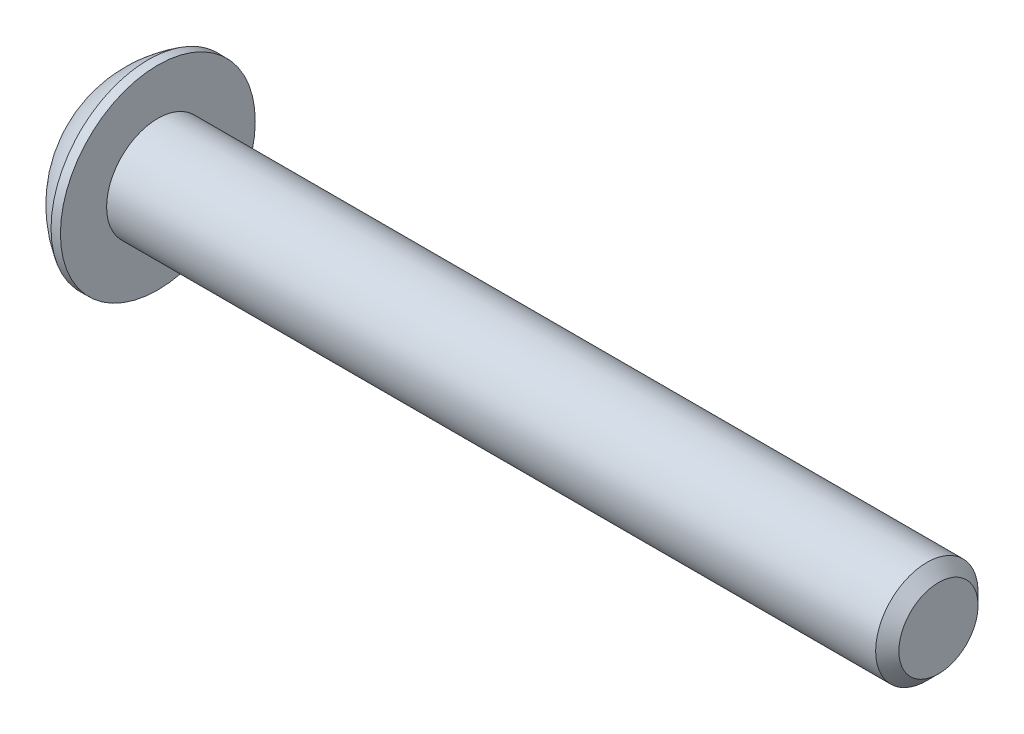
ISO-10303-21;
HEADER;
FILE_DESCRIPTION(('STEP AP214'),'2;1');
FILE_NAME('part.step','',(''),(''),'','','');
FILE_SCHEMA(('AUTOMOTIVE_DESIGN { 1 0 10303 214 1 1 1 1 }'));
ENDSEC;
DATA;
#1=APPLICATION_CONTEXT('core data for automotive mechanical design processes');
#2=APPLICATION_PROTOCOL_DEFINITION('international standard','automotive_design',2000,#1);
#3=PRODUCT_CONTEXT('',#1,'mechanical');
#4=PRODUCT('Part','Part','',(#3));
#5=PRODUCT_RELATED_PRODUCT_CATEGORY('part','',(#4));
#6=PRODUCT_DEFINITION_FORMATION('','',#4);
#7=PRODUCT_DEFINITION_CONTEXT('part definition',#1,'design');
#8=PRODUCT_DEFINITION('design','',#6,#7);
#9=PRODUCT_DEFINITION_SHAPE('','',#8);
#10=(LENGTH_UNIT() NAMED_UNIT(*) SI_UNIT(.MILLI.,.METRE.));
#11=(NAMED_UNIT(*) PLANE_ANGLE_UNIT() SI_UNIT($,.RADIAN.));
#12=(NAMED_UNIT(*) SI_UNIT($,.STERADIAN.) SOLID_ANGLE_UNIT());
#13=UNCERTAINTY_MEASURE_WITH_UNIT(LENGTH_MEASURE(1.E-05),#10,'distance_accuracy_value','');
#14=(GEOMETRIC_REPRESENTATION_CONTEXT(3) GLOBAL_UNCERTAINTY_ASSIGNED_CONTEXT((#13)) GLOBAL_UNIT_ASSIGNED_CONTEXT((#10,
#11,#12)) REPRESENTATION_CONTEXT('',''));
#15=CARTESIAN_POINT('',(0.,0.,0.));
#16=DIRECTION('',(0.,0.,1.));
#17=DIRECTION('',(1.,0.,0.));
#18=AXIS2_PLACEMENT_3D('',#15,#16,#17);
#19=CARTESIAN_POINT('',(1.32080000000034,0.,0.));
#20=DIRECTION('',(-1.,0.,0.));
#21=DIRECTION('',(0.,0.,1.));
#22=AXIS2_PLACEMENT_3D('',#19,#20,#21);
#23=CONICAL_SURFACE('',#22,1.1937999999998,1.04719755119608);
#24=CARTESIAN_POINT('',(2.01004075135902,0.,4.44089209850063E-13));
#25=VERTEX_POINT('',#24);
#26=VERTEX_LOOP('',#25);
#27=FACE_BOUND('',#26,.T.);
#28=CARTESIAN_POINT('',(1.32080000000009,0.,0.));
#29=DIRECTION('',(-1.,0.,0.));
#30=DIRECTION('',(0.,0.,1.));
#31=AXIS2_PLACEMENT_3D('',#28,#29,#30);
#32=CIRCLE('',#31,1.19380000000024);
#33=CARTESIAN_POINT('',(1.32080000000004,-1.03386112703797,0.59690000000006));
#34=VERTEX_POINT('',#33);
#35=CARTESIAN_POINT('',(1.32080000000004,0.,1.19380000000012));
#36=VERTEX_POINT('',#35);
#37=EDGE_CURVE('E19',#34,#36,#32,.T.);
#38=ORIENTED_EDGE('',*,*,#37,.T.);
#39=CARTESIAN_POINT('',(1.32080000000009,0.,0.));
#40=DIRECTION('',(-1.,0.,0.));
#41=DIRECTION('',(0.,0.,1.));
#42=AXIS2_PLACEMENT_3D('',#39,#40,#41);
#43=CIRCLE('',#42,1.19380000000024);
#44=CARTESIAN_POINT('',(1.32080000000004,1.03386112703797,0.596900000000061));
#45=VERTEX_POINT('',#44);
#46=EDGE_CURVE('E148',#36,#45,#43,.T.);
#47=ORIENTED_EDGE('',*,*,#46,.T.);
#48=CARTESIAN_POINT('',(1.32080000000009,0.,0.));
#49=DIRECTION('',(-1.,0.,0.));
#50=DIRECTION('',(0.,0.,1.));
#51=AXIS2_PLACEMENT_3D('',#48,#49,#50);
#52=CIRCLE('',#51,1.19380000000024);
#53=CARTESIAN_POINT('',(1.32080000000004,1.03386112703797,-0.596900000000061));
#54=VERTEX_POINT('',#53);
#55=EDGE_CURVE('E318',#45,#54,#52,.T.);
#56=ORIENTED_EDGE('',*,*,#55,.T.);
#57=CARTESIAN_POINT('',(1.32080000000009,0.,0.));
#58=DIRECTION('',(-1.,0.,0.));
#59=DIRECTION('',(0.,0.,1.));
#60=AXIS2_PLACEMENT_3D('',#57,#58,#59);
#61=CIRCLE('',#60,1.19380000000024);
#62=CARTESIAN_POINT('',(1.32080000000004,1.49457637585666E-12,-1.19380000000012));
#63=VERTEX_POINT('',#62);
#64=EDGE_CURVE('E319',#54,#63,#61,.T.);
#65=ORIENTED_EDGE('',*,*,#64,.T.);
#66=CARTESIAN_POINT('',(1.32080000000009,0.,0.));
#67=DIRECTION('',(-1.,0.,0.));
#68=DIRECTION('',(0.,0.,1.));
#69=AXIS2_PLACEMENT_3D('',#66,#67,#68);
#70=CIRCLE('',#69,1.19380000000024);
#71=CARTESIAN_POINT('',(1.32080000000004,-1.03386112703797,-0.59690000000006));
#72=VERTEX_POINT('',#71);
#73=EDGE_CURVE('E92',#63,#72,#70,.T.);
#74=ORIENTED_EDGE('',*,*,#73,.T.);
#75=CARTESIAN_POINT('',(1.32080000000009,0.,0.));
#76=DIRECTION('',(-1.,0.,0.));
#77=DIRECTION('',(0.,0.,1.));
#78=AXIS2_PLACEMENT_3D('',#75,#76,#77);
#79=CIRCLE('',#78,1.19380000000024);
#80=EDGE_CURVE('E88',#72,#34,#79,.T.);
#81=ORIENTED_EDGE('',*,*,#80,.T.);
#82=EDGE_LOOP('',(#38,#47,#56,#65,#74,#81));
#83=FACE_BOUND('',#82,.T.);
#84=ADVANCED_FACE('F16',(#27,#83),#23,.F.);
#85=CARTESIAN_POINT('',(1.3208,-2.06772225407572,-1.1938));
#86=DIRECTION('',(1.,0.,0.));
#87=DIRECTION('',(0.,0.,-1.));
#88=AXIS2_PLACEMENT_3D('',#85,#86,#87);
#89=PLANE('',#88);
#90=DIRECTION('',(0.,0.5,0.866025403784439));
#91=VECTOR('',#90,1.);
#92=CARTESIAN_POINT('',(1.3208,-1.37848150271715,0.));
#93=LINE('',#92,#91);
#94=CARTESIAN_POINT('',(1.3208,-0.689240751358574,1.1938));
#95=VERTEX_POINT('',#94);
#96=EDGE_CURVE('E100',#95,#34,#93,.F.);
#97=ORIENTED_EDGE('',*,*,#96,.F.);
#98=DIRECTION('',(0.,1.,0.));
#99=VECTOR('',#98,1.);
#100=CARTESIAN_POINT('',(1.3208,-0.689240751358574,1.1938));
#101=LINE('',#100,#99);
#102=EDGE_CURVE('E102',#36,#95,#101,.F.);
#103=ORIENTED_EDGE('',*,*,#102,.F.);
#104=ORIENTED_EDGE('',*,*,#37,.F.);
#105=EDGE_LOOP('',(#97,#103,#104));
#106=FACE_BOUND('',#105,.T.);
#107=ADVANCED_FACE('F98',(#106),#89,.F.);
#108=CARTESIAN_POINT('',(1.3208,-2.06772225407572,-1.1938));
#109=DIRECTION('',(1.,0.,0.));
#110=DIRECTION('',(0.,0.,-1.));
#111=AXIS2_PLACEMENT_3D('',#108,#109,#110);
#112=PLANE('',#111);
#113=DIRECTION('',(0.,-0.5,0.866025403784439));
#114=VECTOR('',#113,1.);
#115=CARTESIAN_POINT('',(1.3208,-0.689240751358574,-1.1938));
#116=LINE('',#115,#114);
#117=CARTESIAN_POINT('',(1.3208,-1.37848150271715,0.));
#118=VERTEX_POINT('',#117);
#119=EDGE_CURVE('E108',#118,#72,#116,.F.);
#120=ORIENTED_EDGE('',*,*,#119,.F.);
#121=DIRECTION('',(0.,0.5,0.866025403784439));
#122=VECTOR('',#121,1.);
#123=CARTESIAN_POINT('',(1.3208,-1.37848150271715,0.));
#124=LINE('',#123,#122);
#125=EDGE_CURVE('E105',#34,#118,#124,.F.);
#126=ORIENTED_EDGE('',*,*,#125,.F.);
#127=ORIENTED_EDGE('',*,*,#80,.F.);
#128=EDGE_LOOP('',(#120,#126,#127));
#129=FACE_BOUND('',#128,.T.);
#130=ADVANCED_FACE('F106',(#129),#112,.F.);
#131=CARTESIAN_POINT('',(1.3208,-2.06772225407572,-1.1938));
#132=DIRECTION('',(1.,0.,0.));
#133=DIRECTION('',(0.,0.,-1.));
#134=AXIS2_PLACEMENT_3D('',#131,#132,#133);
#135=PLANE('',#134);
#136=DIRECTION('',(0.,1.,0.));
#137=VECTOR('',#136,1.);
#138=CARTESIAN_POINT('',(1.3208,0.689240751358577,-1.1938));
#139=LINE('',#138,#137);
#140=CARTESIAN_POINT('',(1.3208,-0.689240751358574,-1.1938));
#141=VERTEX_POINT('',#140);
#142=EDGE_CURVE('E288',#141,#63,#139,.T.);
#143=ORIENTED_EDGE('',*,*,#142,.F.);
#144=DIRECTION('',(0.,-0.5,0.866025403784439));
#145=VECTOR('',#144,1.);
#146=CARTESIAN_POINT('',(1.3208,-0.689240751358574,-1.1938));
#147=LINE('',#146,#145);
#148=EDGE_CURVE('E300',#72,#141,#147,.F.);
#149=ORIENTED_EDGE('',*,*,#148,.F.);
#150=ORIENTED_EDGE('',*,*,#73,.F.);
#151=EDGE_LOOP('',(#143,#149,#150));
#152=FACE_BOUND('',#151,.T.);
#153=ADVANCED_FACE('F191',(#152),#135,.F.);
#154=CARTESIAN_POINT('',(1.3208,-2.06772225407572,-1.1938));
#155=DIRECTION('',(1.,0.,0.));
#156=DIRECTION('',(0.,0.,-1.));
#157=AXIS2_PLACEMENT_3D('',#154,#155,#156);
#158=PLANE('',#157);
#159=DIRECTION('',(0.,-0.5,-0.866025403784439));
#160=VECTOR('',#159,1.);
#161=CARTESIAN_POINT('',(1.3208,1.37848150271715,0.));
#162=LINE('',#161,#160);
#163=CARTESIAN_POINT('',(1.3208,0.689240751358577,-1.1938));
#164=VERTEX_POINT('',#163);
#165=EDGE_CURVE('E274',#164,#54,#162,.F.);
#166=ORIENTED_EDGE('',*,*,#165,.F.);
#167=DIRECTION('',(0.,1.,0.));
#168=VECTOR('',#167,1.);
#169=CARTESIAN_POINT('',(1.3208,0.689240751358577,-1.1938));
#170=LINE('',#169,#168);
#171=EDGE_CURVE('E285',#63,#164,#170,.T.);
#172=ORIENTED_EDGE('',*,*,#171,.F.);
#173=ORIENTED_EDGE('',*,*,#64,.F.);
#174=EDGE_LOOP('',(#166,#172,#173));
#175=FACE_BOUND('',#174,.T.);
#176=ADVANCED_FACE('F187',(#175),#158,.F.);
#177=CARTESIAN_POINT('',(1.3208,-2.06772225407572,-1.1938));
#178=DIRECTION('',(1.,0.,0.));
#179=DIRECTION('',(0.,0.,-1.));
#180=AXIS2_PLACEMENT_3D('',#177,#178,#179);
#181=PLANE('',#180);
#182=DIRECTION('',(0.,0.5,-0.866025403784439));
#183=VECTOR('',#182,1.);
#184=CARTESIAN_POINT('',(1.3208,0.689240751358576,1.1938));
#185=LINE('',#184,#183);
#186=CARTESIAN_POINT('',(1.3208,1.37848150271715,0.));
#187=VERTEX_POINT('',#186);
#188=EDGE_CURVE('E253',#187,#45,#185,.F.);
#189=ORIENTED_EDGE('',*,*,#188,.F.);
#190=DIRECTION('',(0.,-0.5,-0.866025403784439));
#191=VECTOR('',#190,1.);
#192=CARTESIAN_POINT('',(1.3208,1.37848150271715,0.));
#193=LINE('',#192,#191);
#194=EDGE_CURVE('E272',#54,#187,#193,.F.);
#195=ORIENTED_EDGE('',*,*,#194,.F.);
#196=ORIENTED_EDGE('',*,*,#55,.F.);
#197=EDGE_LOOP('',(#189,#195,#196));
#198=FACE_BOUND('',#197,.T.);
#199=ADVANCED_FACE('F183',(#198),#181,.F.);
#200=CARTESIAN_POINT('',(1.3208,-2.06772225407572,-1.1938));
#201=DIRECTION('',(1.,0.,0.));
#202=DIRECTION('',(0.,0.,-1.));
#203=AXIS2_PLACEMENT_3D('',#200,#201,#202);
#204=PLANE('',#203);
#205=DIRECTION('',(0.,1.,0.));
#206=VECTOR('',#205,1.);
#207=CARTESIAN_POINT('',(1.3208,-0.689240751358574,1.1938));
#208=LINE('',#207,#206);
#209=CARTESIAN_POINT('',(1.3208,0.689240751358576,1.1938));
#210=VERTEX_POINT('',#209);
#211=EDGE_CURVE('E117',#210,#36,#208,.F.);
#212=ORIENTED_EDGE('',*,*,#211,.F.);
#213=DIRECTION('',(0.,0.5,-0.866025403784439));
#214=VECTOR('',#213,1.);
#215=CARTESIAN_POINT('',(1.3208,0.689240751358576,1.1938));
#216=LINE('',#215,#214);
#217=EDGE_CURVE('E256',#45,#210,#216,.F.);
#218=ORIENTED_EDGE('',*,*,#217,.F.);
#219=ORIENTED_EDGE('',*,*,#46,.F.);
#220=EDGE_LOOP('',(#212,#218,#219));
#221=FACE_BOUND('',#220,.T.);
#222=ADVANCED_FACE('F179',(#221),#204,.F.);
#223=CARTESIAN_POINT('',(1.3208,-0.689240751358574,1.1938));
#224=DIRECTION('',(0.,0.,-1.));
#225=DIRECTION('',(0.,1.,0.));
#226=AXIS2_PLACEMENT_3D('',#223,#224,#225);
#227=PLANE('',#226);
#228=DIRECTION('',(0.,1.,0.));
#229=VECTOR('',#228,1.);
#230=CARTESIAN_POINT('',(0.,0.,1.1938));
#231=LINE('',#230,#229);
#232=CARTESIAN_POINT('',(0.,0.689240751358577,1.1938));
#233=VERTEX_POINT('',#232);
#234=CARTESIAN_POINT('',(0.,-0.689240751358574,1.1938));
#235=VERTEX_POINT('',#234);
#236=EDGE_CURVE('E250',#233,#235,#231,.F.);
#237=ORIENTED_EDGE('',*,*,#236,.F.);
#238=DIRECTION('',(1.,0.,0.));
#239=VECTOR('',#238,1.);
#240=CARTESIAN_POINT('',(1.3208,0.689240751358576,1.1938));
#241=LINE('',#240,#239);
#242=EDGE_CURVE('E262',#210,#233,#241,.F.);
#243=ORIENTED_EDGE('',*,*,#242,.F.);
#244=ORIENTED_EDGE('',*,*,#211,.T.);
#245=ORIENTED_EDGE('',*,*,#102,.T.);
#246=DIRECTION('',(1.,0.,0.));
#247=VECTOR('',#246,1.);
#248=CARTESIAN_POINT('',(1.3208,-0.689240751358574,1.1938));
#249=LINE('',#248,#247);
#250=EDGE_CURVE('E111',#235,#95,#249,.T.);
#251=ORIENTED_EDGE('',*,*,#250,.F.);
#252=EDGE_LOOP('',(#237,#243,#244,#245,#251));
#253=FACE_BOUND('',#252,.T.);
#254=ADVANCED_FACE('F176',(#253),#227,.T.);
#255=CARTESIAN_POINT('',(1.3208,-1.37848150271715,0.));
#256=DIRECTION('',(0.,0.866025403784439,-0.5));
#257=DIRECTION('',(0.,0.5,0.866025403784439));
#258=AXIS2_PLACEMENT_3D('',#255,#256,#257);
#259=PLANE('',#258);
#260=DIRECTION('',(0.,-0.5,-0.866025403784439));
#261=VECTOR('',#260,1.);
#262=CARTESIAN_POINT('',(0.,-0.689240751358574,1.1938));
#263=LINE('',#262,#261);
#264=CARTESIAN_POINT('',(0.,-1.37848150271715,0.));
#265=VERTEX_POINT('',#264);
#266=EDGE_CURVE('E247',#235,#265,#263,.T.);
#267=ORIENTED_EDGE('',*,*,#266,.F.);
#268=ORIENTED_EDGE('',*,*,#250,.T.);
#269=ORIENTED_EDGE('',*,*,#96,.T.);
#270=ORIENTED_EDGE('',*,*,#125,.T.);
#271=DIRECTION('',(1.,0.,0.));
#272=VECTOR('',#271,1.);
#273=CARTESIAN_POINT('',(1.3208,-1.37848150271715,0.));
#274=LINE('',#273,#272);
#275=EDGE_CURVE('E297',#265,#118,#274,.T.);
#276=ORIENTED_EDGE('',*,*,#275,.F.);
#277=EDGE_LOOP('',(#267,#268,#269,#270,#276));
#278=FACE_BOUND('',#277,.T.);
#279=ADVANCED_FACE('F115',(#278),#259,.T.);
#280=CARTESIAN_POINT('',(1.3208,-0.689240751358574,-1.1938));
#281=DIRECTION('',(0.,0.866025403784439,0.5));
#282=DIRECTION('',(0.,-0.5,0.866025403784439));
#283=AXIS2_PLACEMENT_3D('',#280,#281,#282);
#284=PLANE('',#283);
#285=DIRECTION('',(0.,0.5,-0.866025403784439));
#286=VECTOR('',#285,1.);
#287=CARTESIAN_POINT('',(0.,-1.37848150271715,0.));
#288=LINE('',#287,#286);
#289=CARTESIAN_POINT('',(0.,-0.689240751358574,-1.1938));
#290=VERTEX_POINT('',#289);
#291=EDGE_CURVE('E244',#265,#290,#288,.T.);
#292=ORIENTED_EDGE('',*,*,#291,.F.);
#293=ORIENTED_EDGE('',*,*,#275,.T.);
#294=ORIENTED_EDGE('',*,*,#119,.T.);
#295=ORIENTED_EDGE('',*,*,#148,.T.);
#296=DIRECTION('',(1.,0.,0.));
#297=VECTOR('',#296,1.);
#298=CARTESIAN_POINT('',(1.3208,-0.689240751358574,-1.1938));
#299=LINE('',#298,#297);
#300=EDGE_CURVE('E282',#290,#141,#299,.T.);
#301=ORIENTED_EDGE('',*,*,#300,.F.);
#302=EDGE_LOOP('',(#292,#293,#294,#295,#301));
#303=FACE_BOUND('',#302,.T.);
#304=ADVANCED_FACE('F169',(#303),#284,.T.);
#305=CARTESIAN_POINT('',(1.3208,0.689240751358577,-1.1938));
#306=DIRECTION('',(0.,0.,1.));
#307=DIRECTION('',(1.,0.,0.));
#308=AXIS2_PLACEMENT_3D('',#305,#306,#307);
#309=PLANE('',#308);
#310=DIRECTION('',(0.,1.,0.));
#311=VECTOR('',#310,1.);
#312=CARTESIAN_POINT('',(0.,0.,-1.1938));
#313=LINE('',#312,#311);
#314=CARTESIAN_POINT('',(0.,0.689240751358577,-1.1938));
#315=VERTEX_POINT('',#314);
#316=EDGE_CURVE('E241',#290,#315,#313,.T.);
#317=ORIENTED_EDGE('',*,*,#316,.F.);
#318=ORIENTED_EDGE('',*,*,#300,.T.);
#319=ORIENTED_EDGE('',*,*,#142,.T.);
#320=ORIENTED_EDGE('',*,*,#171,.T.);
#321=DIRECTION('',(1.,0.,0.));
#322=VECTOR('',#321,1.);
#323=CARTESIAN_POINT('',(1.3208,0.689240751358577,-1.1938));
#324=LINE('',#323,#322);
#325=EDGE_CURVE('E257',#315,#164,#324,.T.);
#326=ORIENTED_EDGE('',*,*,#325,.F.);
#327=EDGE_LOOP('',(#317,#318,#319,#320,#326));
#328=FACE_BOUND('',#327,.T.);
#329=ADVANCED_FACE('F166',(#328),#309,.T.);
#330=CARTESIAN_POINT('',(1.3208,1.37848150271715,0.));
#331=DIRECTION('',(0.,-0.866025403784439,0.5));
#332=DIRECTION('',(0.,-0.5,-0.866025403784439));
#333=AXIS2_PLACEMENT_3D('',#330,#331,#332);
#334=PLANE('',#333);
#335=DIRECTION('',(0.,0.5,0.866025403784439));
#336=VECTOR('',#335,1.);
#337=CARTESIAN_POINT('',(0.,0.689240751358577,-1.1938));
#338=LINE('',#337,#336);
#339=CARTESIAN_POINT('',(0.,1.37848150271715,0.));
#340=VERTEX_POINT('',#339);
#341=EDGE_CURVE('E238',#315,#340,#338,.T.);
#342=ORIENTED_EDGE('',*,*,#341,.F.);
#343=ORIENTED_EDGE('',*,*,#325,.T.);
#344=ORIENTED_EDGE('',*,*,#165,.T.);
#345=ORIENTED_EDGE('',*,*,#194,.T.);
#346=DIRECTION('',(1.,0.,0.));
#347=VECTOR('',#346,1.);
#348=CARTESIAN_POINT('',(1.3208,1.37848150271715,0.));
#349=LINE('',#348,#347);
#350=EDGE_CURVE('E34',#340,#187,#349,.T.);
#351=ORIENTED_EDGE('',*,*,#350,.F.);
#352=EDGE_LOOP('',(#342,#343,#344,#345,#351));
#353=FACE_BOUND('',#352,.T.);
#354=ADVANCED_FACE('F162',(#353),#334,.T.);
#355=CARTESIAN_POINT('',(1.3208,0.689240751358576,1.1938));
#356=DIRECTION('',(0.,-0.866025403784439,-0.5));
#357=DIRECTION('',(0.,0.5,-0.866025403784439));
#358=AXIS2_PLACEMENT_3D('',#355,#356,#357);
#359=PLANE('',#358);
#360=DIRECTION('',(0.,-0.5,0.866025403784439));
#361=VECTOR('',#360,1.);
#362=CARTESIAN_POINT('',(0.,1.37848150271715,0.));
#363=LINE('',#362,#361);
#364=EDGE_CURVE('E147',#340,#233,#363,.T.);
#365=ORIENTED_EDGE('',*,*,#364,.F.);
#366=ORIENTED_EDGE('',*,*,#350,.T.);
#367=ORIENTED_EDGE('',*,*,#188,.T.);
#368=ORIENTED_EDGE('',*,*,#217,.T.);
#369=ORIENTED_EDGE('',*,*,#242,.T.);
#370=EDGE_LOOP('',(#365,#366,#367,#368,#369));
#371=FACE_BOUND('',#370,.T.);
#372=ADVANCED_FACE('F158',(#371),#359,.T.);
#373=CARTESIAN_POINT('',(0.,0.,0.));
#374=DIRECTION('',(-1.,0.,0.));
#375=DIRECTION('',(0.,0.,1.));
#376=AXIS2_PLACEMENT_3D('',#373,#374,#375);
#377=PLANE('',#376);
#378=ORIENTED_EDGE('',*,*,#341,.T.);
#379=ORIENTED_EDGE('',*,*,#364,.T.);
#380=ORIENTED_EDGE('',*,*,#236,.T.);
#381=ORIENTED_EDGE('',*,*,#266,.T.);
#382=ORIENTED_EDGE('',*,*,#291,.T.);
#383=ORIENTED_EDGE('',*,*,#316,.T.);
#384=EDGE_LOOP('',(#378,#379,#380,#381,#382,#383));
#385=FACE_BOUND('',#384,.T.);
#386=CARTESIAN_POINT('',(0.,1.9812,0.));
#387=CARTESIAN_POINT('',(0.,1.9811996664299,0.0556258831179428));
#388=CARTESIAN_POINT('',(0.,1.97885520380442,0.111261989398606));
#389=CARTESIAN_POINT('',(0.,1.96949260169541,0.222149719830458));
#390=CARTESIAN_POINT('',(0.,1.96247308239605,0.277401225602895));
#391=CARTESIAN_POINT('',(0.,1.94379192841038,0.387209508139747));
#392=CARTESIAN_POINT('',(-1.85325793235264E-13,1.93212292489526,0.441765039546365));
#393=CARTESIAN_POINT('',(1.86344214223505E-13,1.90422331175315,0.549729449347493));
#394=CARTESIAN_POINT('',(6.94543371897454E-13,1.88798900035338,0.603137359208869));
#395=CARTESIAN_POINT('',(1.15501975216981E-12,1.83266214476501,0.760839131321828));
#396=CARTESIAN_POINT('',(0.,1.78690023648845,0.862876433575429));
#397=CARTESIAN_POINT('',(0.,1.67887358150667,1.05780719540872));
#398=CARTESIAN_POINT('',(9.54193214892627E-13,1.6166082074585,1.15070030720801));
#399=CARTESIAN_POINT('',(5.94805591894675E-13,1.51224157140982,1.28116890915697));
#400=CARTESIAN_POINT('',(1.63221293851378E-13,1.4755970394354,1.32320451127026));
#401=CARTESIAN_POINT('',(-1.62196980336157E-13,1.39893832619713,1.40400288695709));
#402=CARTESIAN_POINT('',(0.,1.35892742784698,1.44276877695455));
#403=CARTESIAN_POINT('',(1.14362537325405E-13,1.23416504602197,1.55382272417904));
#404=CARTESIAN_POINT('',(0.,1.14466125559859,1.62089527952111));
#405=CARTESIAN_POINT('',(0.,0.955712144178167,1.7390221808118));
#406=CARTESIAN_POINT('',(0.,0.856267198233564,1.79007713076007));
#407=CARTESIAN_POINT('',(0.,0.650206345910843,1.87477637530954));
#408=CARTESIAN_POINT('',(0.,0.543590516134855,1.90842085586267));
#409=CARTESIAN_POINT('',(0.,0.326226155292018,1.95733039300656));
#410=CARTESIAN_POINT('',(0.,0.21547760215793,1.97259535144288));
#411=CARTESIAN_POINT('',(0.,-0.00701040587544639,1.98431697865418));
#412=CARTESIAN_POINT('',(0.,-0.118749860774734,1.98077364742917));
#413=CARTESIAN_POINT('',(0.,-0.340050178355485,1.95497485623825));
#414=CARTESIAN_POINT('',(0.,-0.449611052668255,1.93271949620218));
#415=CARTESIAN_POINT('',(0.,-0.663431110729174,1.87014138774523));
#416=CARTESIAN_POINT('',(0.,-0.76769023783852,1.82981844635272));
#417=CARTESIAN_POINT('',(0.,-0.968005760719347,1.73219968377096));
#418=CARTESIAN_POINT('',(0.,-1.0640618469811,1.6749032225164));
#419=CARTESIAN_POINT('',(0.,-1.19980276751283,1.57757371205873));
#420=CARTESIAN_POINT('',(0.,-1.24366557129213,1.54322665019466));
#421=CARTESIAN_POINT('',(0.,-1.32838995706696,1.47093063174264));
#422=CARTESIAN_POINT('',(0.,-1.36924860178706,1.43297823102439));
#423=CARTESIAN_POINT('',(0.,-1.48674671849223,1.31419842051173));
#424=CARTESIAN_POINT('',(0.,-1.55842832343237,1.22836221289311));
#425=CARTESIAN_POINT('',(0.,-1.6863396856475,1.04586168272493));
#426=CARTESIAN_POINT('',(0.,-1.7425700302488,0.949197771949774));
#427=CARTESIAN_POINT('',(0.,-1.8141614250401,0.798182600298684));
#428=CARTESIAN_POINT('',(0.,-1.83591780585875,0.746776203847791));
#429=CARTESIAN_POINT('',(0.,-1.87500754181092,0.642341081688636));
#430=CARTESIAN_POINT('',(0.,-1.89234447645404,0.589313708122847));
#431=CARTESIAN_POINT('',(0.,-1.92246053433554,0.482076273028395));
#432=CARTESIAN_POINT('',(0.,-1.93524685475118,0.42786822425751));
#433=CARTESIAN_POINT('',(0.,-1.95620937250494,0.318578151844611));
#434=CARTESIAN_POINT('',(0.,-1.96438692958147,0.263496390912872));
#435=CARTESIAN_POINT('',(0.,-1.97388528284653,0.173607715038558));
#436=CARTESIAN_POINT('',(0.,-1.97662743364426,0.138944718024998));
#437=CARTESIAN_POINT('',(0.,-1.98028489645283,0.0695224782567002));
#438=CARTESIAN_POINT('',(0.,-1.98120020846367,0.0347632355019631));
#439=CARTESIAN_POINT('',(0.,-1.9811996664299,-0.0556258831179437));
#440=CARTESIAN_POINT('',(0.,-1.97885520380442,-0.111261989398607));
#441=CARTESIAN_POINT('',(0.,-1.96949260169541,-0.222149719830459));
#442=CARTESIAN_POINT('',(0.,-1.96247308239605,-0.277401225602897));
#443=CARTESIAN_POINT('',(0.,-1.94379192841039,-0.387209508139749));
#444=CARTESIAN_POINT('',(-1.85269749640691E-13,-1.93212292489526,-0.441765039546367));
#445=CARTESIAN_POINT('',(1.86288125054388E-13,-1.90422331175315,-0.549729449347495));
#446=CARTESIAN_POINT('',(6.94525090263764E-13,-1.88798900035338,-0.603137359208872));
#447=CARTESIAN_POINT('',(1.15505622829081E-12,-1.83266214476501,-0.760839131321831));
#448=CARTESIAN_POINT('',(0.,-1.78690023648845,-0.862876433575431));
#449=CARTESIAN_POINT('',(0.,-1.67887358150667,-1.05780719540872));
#450=CARTESIAN_POINT('',(9.54248812869379E-13,-1.6166082074585,-1.15070030720801));
#451=CARTESIAN_POINT('',(5.94777756479239E-13,-1.51224157140982,-1.28116890915698));
#452=CARTESIAN_POINT('',(1.63138949183833E-13,-1.47559703943539,-1.32320451127027));
#453=CARTESIAN_POINT('',(-1.62114715061273E-13,-1.39893832619713,-1.40400288695709));
#454=CARTESIAN_POINT('',(0.,-1.35892742784699,-1.44276877695455));
#455=CARTESIAN_POINT('',(1.13760489124207E-13,-1.23416504602197,-1.55382272417904));
#456=CARTESIAN_POINT('',(0.,-1.14466125559859,-1.62089527952111));
#457=CARTESIAN_POINT('',(0.,-0.95571214417816,-1.73902218081179));
#458=CARTESIAN_POINT('',(0.,-0.856267198233559,-1.79007713076007));
#459=CARTESIAN_POINT('',(0.,-0.650206345910841,-1.87477637530954));
#460=CARTESIAN_POINT('',(0.,-0.543590516134854,-1.90842085586267));
#461=CARTESIAN_POINT('',(0.,-0.326226155292018,-1.95733039300657));
#462=CARTESIAN_POINT('',(0.,-0.215477602157929,-1.97259535144288));
#463=CARTESIAN_POINT('',(0.,0.0070104058754487,-1.98431697865418));
#464=CARTESIAN_POINT('',(0.,0.118749860774737,-1.98077364742916));
#465=CARTESIAN_POINT('',(0.,0.340050178355489,-1.95497485623824));
#466=CARTESIAN_POINT('',(0.,0.44961105266826,-1.93271949620218));
#467=CARTESIAN_POINT('',(0.,0.663431110729178,-1.87014138774524));
#468=CARTESIAN_POINT('',(0.,0.767690237838524,-1.82981844635272));
#469=CARTESIAN_POINT('',(0.,0.968005760719348,-1.73219968377096));
#470=CARTESIAN_POINT('',(0.,1.0640618469811,-1.67490322251639));
#471=CARTESIAN_POINT('',(0.,1.19980276751283,-1.57757371205873));
#472=CARTESIAN_POINT('',(0.,1.24366557129214,-1.54322665019465));
#473=CARTESIAN_POINT('',(0.,1.32838995706696,-1.47093063174263));
#474=CARTESIAN_POINT('',(0.,1.36924860178706,-1.43297823102439));
#475=CARTESIAN_POINT('',(0.,1.48674671849223,-1.31419842051172));
#476=CARTESIAN_POINT('',(0.,1.55842832343237,-1.22836221289311));
#477=CARTESIAN_POINT('',(0.,1.6863396856475,-1.04586168272492));
#478=CARTESIAN_POINT('',(0.,1.7425700302488,-0.949197771949768));
#479=CARTESIAN_POINT('',(0.,1.8141614250401,-0.798182600298677));
#480=CARTESIAN_POINT('',(0.,1.83591780585875,-0.746776203847785));
#481=CARTESIAN_POINT('',(0.,1.87500754181092,-0.64234108168863));
#482=CARTESIAN_POINT('',(0.,1.89234447645404,-0.589313708122841));
#483=CARTESIAN_POINT('',(0.,1.92246053433555,-0.482076273028389));
#484=CARTESIAN_POINT('',(0.,1.93524685475118,-0.427868224257505));
#485=CARTESIAN_POINT('',(0.,1.95620937250494,-0.318578151844605));
#486=CARTESIAN_POINT('',(0.,1.96438692958147,-0.263496390912866));
#487=CARTESIAN_POINT('',(0.,1.97388528284653,-0.173607715038553));
#488=CARTESIAN_POINT('',(0.,1.97662743364426,-0.138944718024994));
#489=CARTESIAN_POINT('',(0.,1.98028489645283,-0.0695224782566989));
#490=CARTESIAN_POINT('',(0.,1.98120020846367,-0.034763235501963));
#491=CARTESIAN_POINT('',(0.,1.9812,0.));
#492=B_SPLINE_CURVE_WITH_KNOTS('',3,(#386,#387,#388,#389,#390,#391,#392,#393,#394,#395,#396,
#397,#398,#399,#400,#401,#402,#403,#404,#405,#406,#407,#408,#409,#410,#411,#412,#413,#414,#415,
#416,#417,#418,#419,#420,#421,#422,#423,#424,#425,#426,#427,#428,#429,#430,#431,#432,#433,#434,
#435,#436,#437,#438,#439,#440,#441,#442,#443,#444,#445,#446,#447,#448,#449,#450,#451,#452,#453,
#454,#455,#456,#457,#458,#459,#460,#461,#462,#463,#464,#465,#466,#467,#468,#469,#470,#471,#472,
#473,#474,#475,#476,#477,#478,#479,#480,#481,#482,#483,#484,#485,#486,#487,#488,#489,#490,#491),
.UNSPECIFIED.,.T.,.F.,(4,2,2,2,2,2,2,2,2,2,2,2,2,2,2,2,2,2,2,2,2,2,2,2,2,2,2,2,2,2,2,2,2,2,2,2,
2,2,2,2,2,2,2,2,2,2,2,2,2,2,2,2,4),(0.,0.166845646007828,0.333740557374255,0.500901034367693,
0.668197445942386,1.00199278686282,1.33580081809885,1.50292354032982,1.6698851310853,
2.00370118900129,2.33750465770544,2.67130456115909,3.005106247238,3.33890793331696,
3.67270783677065,4.00651130547476,4.34032736339026,4.50728895414554,4.67441167637632,
5.00821970761259,5.34201504853332,5.50931146010827,5.67647193710191,5.84336684846844,
6.0102124944764,6.11448220058334,6.21875190669029,6.38559755269812,6.55249246406454,
6.71965294105798,6.88694935263268,7.22074469355311,7.55455272478915,7.72167544702011,
7.88863703777559,8.22245309569158,8.55625656439573,8.89005646784938,9.2238581539283,
9.55765984000725,9.89145974346094,10.2252632121651,10.5590792700806,10.7260408608358,
10.8931635830666,11.2269716143029,11.5607669552236,11.7280633667986,11.8952238437922,
12.0621187551587,12.2289644011667,12.3332341072736,12.4375038133806),.UNSPECIFIED.);
#493=CARTESIAN_POINT('',(0.,1.9812,0.));
#494=VERTEX_POINT('',#493);
#495=EDGE_CURVE('E139',#494,#494,#492,.T.);
#496=ORIENTED_EDGE('',*,*,#495,.F.);
#497=EDGE_LOOP('',(#496));
#498=FACE_BOUND('',#497,.T.);
#499=ADVANCED_FACE('F154',(#385,#498),#377,.T.);
#500=CARTESIAN_POINT('',(4.13385,0.,0.));
#501=DIRECTION('',(0.,1.,0.));
#502=DIRECTION('',(1.,0.,0.));
#503=AXIS2_PLACEMENT_3D('',#500,#501,#502);
#504=SPHERICAL_SURFACE('',#503,4.58408870578439);
#505=CARTESIAN_POINT('',(1.8288,0.,0.));
#506=DIRECTION('',(-1.,0.,0.));
#507=DIRECTION('',(0.,0.,1.));
#508=AXIS2_PLACEMENT_3D('',#505,#506,#507);
#509=CIRCLE('',#508,3.9624);
#510=CARTESIAN_POINT('',(1.8288,0.,3.9624));
#511=VERTEX_POINT('',#510);
#512=EDGE_CURVE('E136',#511,#511,#509,.F.);
#513=ORIENTED_EDGE('',*,*,#512,.F.);
#514=EDGE_LOOP('',(#513));
#515=FACE_BOUND('',#514,.T.);
#516=ORIENTED_EDGE('',*,*,#495,.T.);
#517=EDGE_LOOP('',(#516));
#518=FACE_BOUND('',#517,.T.);
#519=ADVANCED_FACE('F150',(#515,#518),#504,.T.);
#520=CARTESIAN_POINT('',(33.9598,0.,0.));
#521=DIRECTION('',(-1.,0.,0.));
#522=DIRECTION('',(0.,0.,1.));
#523=AXIS2_PLACEMENT_3D('',#520,#521,#522);
#524=PLANE('',#523);
#525=CARTESIAN_POINT('',(33.9597999999341,0.,0.));
#526=DIRECTION('',(-1.,0.,0.));
#527=DIRECTION('',(0.,0.,1.));
#528=AXIS2_PLACEMENT_3D('',#525,#526,#527);
#529=CIRCLE('',#528,1.61036000002923);
#530=CARTESIAN_POINT('',(33.9597999999341,0.,1.61036000002923));
#531=VERTEX_POINT('',#530);
#532=EDGE_CURVE('E133',#531,#531,#529,.T.);
#533=ORIENTED_EDGE('',*,*,#532,.F.);
#534=EDGE_LOOP('',(#533));
#535=FACE_BOUND('',#534,.T.);
#536=ADVANCED_FACE('F222',(#535),#524,.F.);
#537=CARTESIAN_POINT('',(0.,0.,0.));
#538=DIRECTION('',(-1.,0.,0.));
#539=DIRECTION('',(0.,0.,1.));
#540=AXIS2_PLACEMENT_3D('',#537,#538,#539);
#541=CYLINDRICAL_SURFACE('',#540,3.9624);
#542=ORIENTED_EDGE('',*,*,#512,.T.);
#543=EDGE_LOOP('',(#542));
#544=FACE_BOUND('',#543,.T.);
#545=CARTESIAN_POINT('',(2.2098,0.,0.));
#546=DIRECTION('',(-1.,0.,0.));
#547=DIRECTION('',(0.,0.,1.));
#548=AXIS2_PLACEMENT_3D('',#545,#546,#547);
#549=CIRCLE('',#548,3.9624);
#550=CARTESIAN_POINT('',(2.2098,0.,3.9624));
#551=VERTEX_POINT('',#550);
#552=EDGE_CURVE('E130',#551,#551,#549,.T.);
#553=ORIENTED_EDGE('',*,*,#552,.T.);
#554=EDGE_LOOP('',(#553));
#555=FACE_BOUND('',#554,.T.);
#556=ADVANCED_FACE('F219',(#544,#555),#541,.T.);
#557=CARTESIAN_POINT('',(33.4873600000378,0.,0.));
#558=DIRECTION('',(-1.,0.,0.));
#559=DIRECTION('',(0.,0.,1.));
#560=AXIS2_PLACEMENT_3D('',#557,#558,#559);
#561=CONICAL_SURFACE('',#560,2.08279999992556,0.785398163397448);
#562=ORIENTED_EDGE('',*,*,#532,.T.);
#563=EDGE_LOOP('',(#562));
#564=FACE_BOUND('',#563,.T.);
#565=CARTESIAN_POINT('',(33.48736,0.,0.));
#566=DIRECTION('',(-1.,0.,0.));
#567=DIRECTION('',(0.,0.,1.));
#568=AXIS2_PLACEMENT_3D('',#565,#566,#567);
#569=CIRCLE('',#568,2.0828);
#570=CARTESIAN_POINT('',(33.48736,0.,2.0828));
#571=VERTEX_POINT('',#570);
#572=EDGE_CURVE('E25',#571,#571,#569,.T.);
#573=ORIENTED_EDGE('',*,*,#572,.F.);
#574=EDGE_LOOP('',(#573));
#575=FACE_BOUND('',#574,.T.);
#576=ADVANCED_FACE('F211',(#564,#575),#561,.T.);
#577=CARTESIAN_POINT('',(2.2098,2.0828,0.));
#578=DIRECTION('',(-1.,0.,0.));
#579=DIRECTION('',(0.,0.,1.));
#580=AXIS2_PLACEMENT_3D('',#577,#578,#579);
#581=PLANE('',#580);
#582=CARTESIAN_POINT('',(2.2098,0.,0.));
#583=DIRECTION('',(-1.,0.,0.));
#584=DIRECTION('',(0.,0.,1.));
#585=AXIS2_PLACEMENT_3D('',#582,#583,#584);
#586=CIRCLE('',#585,2.0828);
#587=CARTESIAN_POINT('',(2.2098,0.,2.0828));
#588=VERTEX_POINT('',#587);
#589=EDGE_CURVE('E11',#588,#588,#586,.F.);
#590=ORIENTED_EDGE('',*,*,#589,.F.);
#591=EDGE_LOOP('',(#590));
#592=FACE_BOUND('',#591,.T.);
#593=ORIENTED_EDGE('',*,*,#552,.F.);
#594=EDGE_LOOP('',(#593));
#595=FACE_BOUND('',#594,.T.);
#596=ADVANCED_FACE('F205',(#592,#595),#581,.F.);
#597=CARTESIAN_POINT('',(0.,0.,0.));
#598=DIRECTION('',(-1.,0.,0.));
#599=DIRECTION('',(0.,0.,1.));
#600=AXIS2_PLACEMENT_3D('',#597,#598,#599);
#601=CYLINDRICAL_SURFACE('',#600,2.0828);
#602=ORIENTED_EDGE('',*,*,#572,.T.);
#603=EDGE_LOOP('',(#602));
#604=FACE_BOUND('',#603,.T.);
#605=ORIENTED_EDGE('',*,*,#589,.T.);
#606=EDGE_LOOP('',(#605));
#607=FACE_BOUND('',#606,.T.);
#608=ADVANCED_FACE('F203',(#604,#607),#601,.T.);
#609=CLOSED_SHELL('',(#84,#107,#130,#153,#176,#199,#222,#254,#279,#304,#329,#354,#372,#499,#519,
#536,#556,#576,#596,#608));
#610=MANIFOLD_SOLID_BREP('B1',#609);
#611=ADVANCED_BREP_SHAPE_REPRESENTATION('',(#18,#610),#14);
#612=SHAPE_DEFINITION_REPRESENTATION(#9,#611);
ENDSEC;
END-ISO-10303-21;
